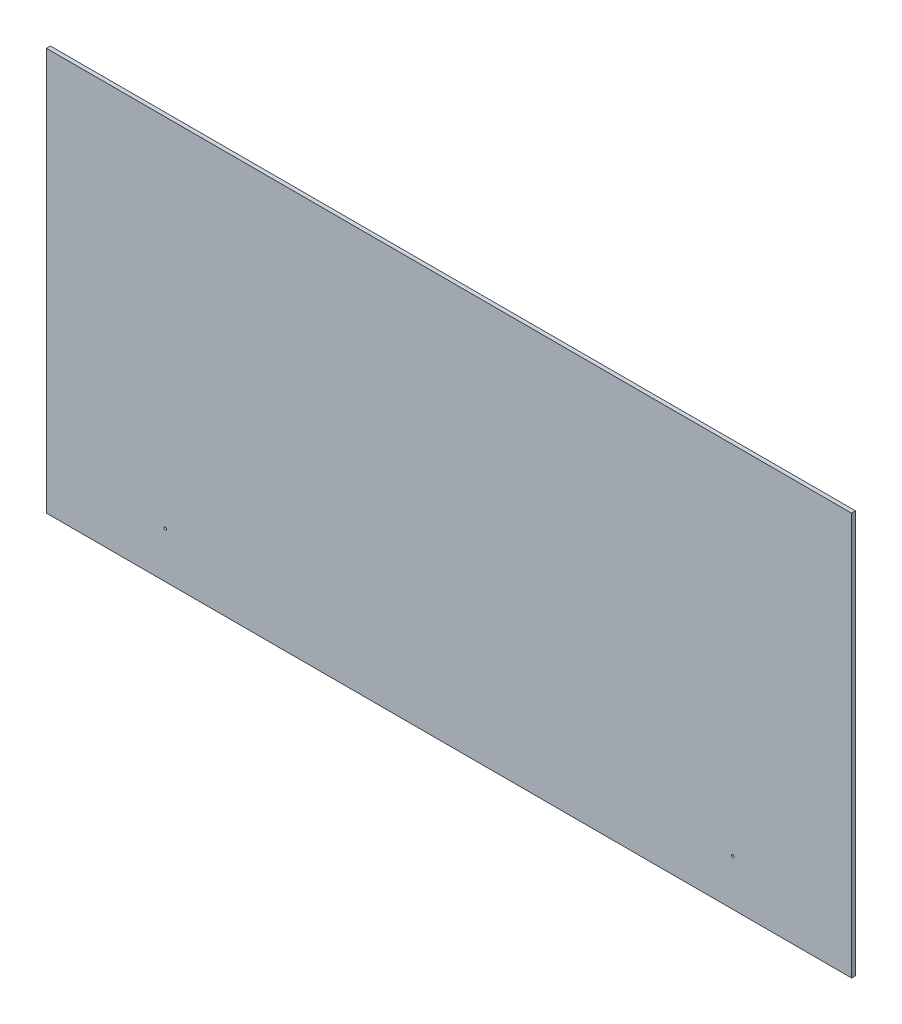
ISO-10303-21;
HEADER;
FILE_DESCRIPTION(('STEP AP214'),'2;1');
FILE_NAME('part.step','',(''),(''),'','','');
FILE_SCHEMA(('AUTOMOTIVE_DESIGN { 1 0 10303 214 1 1 1 1 }'));
ENDSEC;
DATA;
#1=APPLICATION_CONTEXT('core data for automotive mechanical design processes');
#2=APPLICATION_PROTOCOL_DEFINITION('international standard','automotive_design',2000,#1);
#3=PRODUCT_CONTEXT('',#1,'mechanical');
#4=PRODUCT('Part','Part','',(#3));
#5=PRODUCT_RELATED_PRODUCT_CATEGORY('part','',(#4));
#6=PRODUCT_DEFINITION_FORMATION('','',#4);
#7=PRODUCT_DEFINITION_CONTEXT('part definition',#1,'design');
#8=PRODUCT_DEFINITION('design','',#6,#7);
#9=PRODUCT_DEFINITION_SHAPE('','',#8);
#10=(LENGTH_UNIT() NAMED_UNIT(*) SI_UNIT(.MILLI.,.METRE.));
#11=(NAMED_UNIT(*) PLANE_ANGLE_UNIT() SI_UNIT($,.RADIAN.));
#12=(NAMED_UNIT(*) SI_UNIT($,.STERADIAN.) SOLID_ANGLE_UNIT());
#13=UNCERTAINTY_MEASURE_WITH_UNIT(LENGTH_MEASURE(1.E-05),#10,'distance_accuracy_value','');
#14=(GEOMETRIC_REPRESENTATION_CONTEXT(3) GLOBAL_UNCERTAINTY_ASSIGNED_CONTEXT((#13)) GLOBAL_UNIT_ASSIGNED_CONTEXT((#10,
#11,#12)) REPRESENTATION_CONTEXT('',''));
#15=CARTESIAN_POINT('',(0.,0.,0.));
#16=DIRECTION('',(0.,0.,1.));
#17=DIRECTION('',(1.,0.,0.));
#18=AXIS2_PLACEMENT_3D('',#15,#16,#17);
#19=CARTESIAN_POINT('',(0.,0.,6.));
#20=DIRECTION('',(-1.,0.,0.));
#21=DIRECTION('',(0.,0.,1.));
#22=AXIS2_PLACEMENT_3D('',#19,#20,#21);
#23=PLANE('',#22);
#24=DIRECTION('',(0.,1.,0.));
#25=VECTOR('',#24,1.);
#26=CARTESIAN_POINT('',(0.,0.,0.));
#27=LINE('',#26,#25);
#28=CARTESIAN_POINT('',(0.,0.,0.));
#29=VERTEX_POINT('',#28);
#30=CARTESIAN_POINT('',(0.,610.,0.));
#31=VERTEX_POINT('',#30);
#32=EDGE_CURVE('E108',#29,#31,#27,.T.);
#33=ORIENTED_EDGE('',*,*,#32,.T.);
#34=DIRECTION('',(0.,0.,-1.));
#35=VECTOR('',#34,1.);
#36=CARTESIAN_POINT('',(0.,610.,6.));
#37=LINE('',#36,#35);
#38=CARTESIAN_POINT('',(0.,610.,6.));
#39=VERTEX_POINT('',#38);
#40=EDGE_CURVE('E11',#39,#31,#37,.T.);
#41=ORIENTED_EDGE('',*,*,#40,.F.);
#42=DIRECTION('',(0.,1.,0.));
#43=VECTOR('',#42,1.);
#44=CARTESIAN_POINT('',(0.,0.,6.));
#45=LINE('',#44,#43);
#46=CARTESIAN_POINT('',(0.,0.,6.));
#47=VERTEX_POINT('',#46);
#48=EDGE_CURVE('E96',#47,#39,#45,.T.);
#49=ORIENTED_EDGE('',*,*,#48,.F.);
#50=DIRECTION('',(0.,0.,-1.));
#51=VECTOR('',#50,1.);
#52=CARTESIAN_POINT('',(0.,0.,6.));
#53=LINE('',#52,#51);
#54=EDGE_CURVE('E104',#47,#29,#53,.T.);
#55=ORIENTED_EDGE('',*,*,#54,.T.);
#56=EDGE_LOOP('',(#33,#41,#49,#55));
#57=FACE_BOUND('',#56,.T.);
#58=ADVANCED_FACE('F45',(#57),#23,.F.);
#59=CARTESIAN_POINT('',(0.,610.,6.));
#60=DIRECTION('',(0.,-1.,0.));
#61=DIRECTION('',(1.,0.,0.));
#62=AXIS2_PLACEMENT_3D('',#59,#60,#61);
#63=PLANE('',#62);
#64=DIRECTION('',(-1.,0.,0.));
#65=VECTOR('',#64,1.);
#66=CARTESIAN_POINT('',(0.,610.,0.));
#67=LINE('',#66,#65);
#68=CARTESIAN_POINT('',(-1220.,610.,0.));
#69=VERTEX_POINT('',#68);
#70=EDGE_CURVE('E100',#31,#69,#67,.T.);
#71=ORIENTED_EDGE('',*,*,#70,.T.);
#72=DIRECTION('',(0.,0.,-1.));
#73=VECTOR('',#72,1.);
#74=CARTESIAN_POINT('',(-1220.,610.,6.));
#75=LINE('',#74,#73);
#76=CARTESIAN_POINT('',(-1220.,610.,6.));
#77=VERTEX_POINT('',#76);
#78=EDGE_CURVE('E53',#77,#69,#75,.T.);
#79=ORIENTED_EDGE('',*,*,#78,.F.);
#80=DIRECTION('',(-1.,0.,0.));
#81=VECTOR('',#80,1.);
#82=CARTESIAN_POINT('',(0.,610.,6.));
#83=LINE('',#82,#81);
#84=EDGE_CURVE('E91',#39,#77,#83,.T.);
#85=ORIENTED_EDGE('',*,*,#84,.F.);
#86=ORIENTED_EDGE('',*,*,#40,.T.);
#87=EDGE_LOOP('',(#71,#79,#85,#86));
#88=FACE_BOUND('',#87,.T.);
#89=ADVANCED_FACE('F99',(#88),#63,.F.);
#90=CARTESIAN_POINT('',(-1220.,-1.49406909495977E-13,6.));
#91=DIRECTION('',(1.,0.,0.));
#92=DIRECTION('',(0.,0.,-1.));
#93=AXIS2_PLACEMENT_3D('',#90,#91,#92);
#94=PLANE('',#93);
#95=DIRECTION('',(0.,-1.,0.));
#96=VECTOR('',#95,1.);
#97=CARTESIAN_POINT('',(-1220.,-1.49406909495977E-13,0.));
#98=LINE('',#97,#96);
#99=CARTESIAN_POINT('',(-1220.,-1.49406909495977E-13,0.));
#100=VERTEX_POINT('',#99);
#101=EDGE_CURVE('E78',#69,#100,#98,.T.);
#102=ORIENTED_EDGE('',*,*,#101,.T.);
#103=DIRECTION('',(0.,0.,-1.));
#104=VECTOR('',#103,1.);
#105=CARTESIAN_POINT('',(-1220.,-1.49406909495977E-13,6.));
#106=LINE('',#105,#104);
#107=CARTESIAN_POINT('',(-1220.,-1.49406909495977E-13,6.));
#108=VERTEX_POINT('',#107);
#109=EDGE_CURVE('E101',#108,#100,#106,.T.);
#110=ORIENTED_EDGE('',*,*,#109,.F.);
#111=DIRECTION('',(0.,-1.,0.));
#112=VECTOR('',#111,1.);
#113=CARTESIAN_POINT('',(-1220.,-1.49406909495977E-13,6.));
#114=LINE('',#113,#112);
#115=EDGE_CURVE('E94',#77,#108,#114,.T.);
#116=ORIENTED_EDGE('',*,*,#115,.F.);
#117=ORIENTED_EDGE('',*,*,#78,.T.);
#118=EDGE_LOOP('',(#102,#110,#116,#117));
#119=FACE_BOUND('',#118,.T.);
#120=ADVANCED_FACE('F102',(#119),#94,.F.);
#121=CARTESIAN_POINT('',(0.,0.,6.));
#122=DIRECTION('',(0.,1.,0.));
#123=DIRECTION('',(-1.,0.,0.));
#124=AXIS2_PLACEMENT_3D('',#121,#122,#123);
#125=PLANE('',#124);
#126=DIRECTION('',(1.,0.,0.));
#127=VECTOR('',#126,1.);
#128=CARTESIAN_POINT('',(0.,0.,0.));
#129=LINE('',#128,#127);
#130=EDGE_CURVE('E84',#100,#29,#129,.T.);
#131=ORIENTED_EDGE('',*,*,#130,.T.);
#132=ORIENTED_EDGE('',*,*,#54,.F.);
#133=DIRECTION('',(1.,0.,0.));
#134=VECTOR('',#133,1.);
#135=CARTESIAN_POINT('',(0.,0.,6.));
#136=LINE('',#135,#134);
#137=EDGE_CURVE('E61',#108,#47,#136,.T.);
#138=ORIENTED_EDGE('',*,*,#137,.F.);
#139=ORIENTED_EDGE('',*,*,#109,.T.);
#140=EDGE_LOOP('',(#131,#132,#138,#139));
#141=FACE_BOUND('',#140,.T.);
#142=ADVANCED_FACE('F116',(#141),#125,.F.);
#143=CARTESIAN_POINT('',(0.,0.,6.));
#144=DIRECTION('',(0.,0.,1.));
#145=DIRECTION('',(1.,0.,0.));
#146=AXIS2_PLACEMENT_3D('',#143,#144,#145);
#147=PLANE('',#146);
#148=CARTESIAN_POINT('',(-1040.,69.9999999999998,6.));
#149=DIRECTION('',(0.,0.,1.));
#150=DIRECTION('',(1.,0.,0.));
#151=AXIS2_PLACEMENT_3D('',#148,#149,#150);
#152=CIRCLE('',#151,2.0000000000001);
#153=CARTESIAN_POINT('',(-1038.,69.9999999999998,6.));
#154=VERTEX_POINT('',#153);
#155=EDGE_CURVE('E125',#154,#154,#152,.T.);
#156=ORIENTED_EDGE('',*,*,#155,.F.);
#157=EDGE_LOOP('',(#156));
#158=FACE_BOUND('',#157,.T.);
#159=CARTESIAN_POINT('',(-180.,69.9999999999998,6.));
#160=DIRECTION('',(0.,0.,1.));
#161=DIRECTION('',(-1.,0.,0.));
#162=AXIS2_PLACEMENT_3D('',#159,#160,#161);
#163=CIRCLE('',#162,2.0000000000001);
#164=CARTESIAN_POINT('',(-182.,69.9999999999998,6.));
#165=VERTEX_POINT('',#164);
#166=EDGE_CURVE('E122',#165,#165,#163,.T.);
#167=ORIENTED_EDGE('',*,*,#166,.F.);
#168=EDGE_LOOP('',(#167));
#169=FACE_BOUND('',#168,.T.);
#170=ORIENTED_EDGE('',*,*,#48,.T.);
#171=ORIENTED_EDGE('',*,*,#84,.T.);
#172=ORIENTED_EDGE('',*,*,#115,.T.);
#173=ORIENTED_EDGE('',*,*,#137,.T.);
#174=EDGE_LOOP('',(#170,#171,#172,#173));
#175=FACE_BOUND('',#174,.T.);
#176=ADVANCED_FACE('F92',(#158,#169,#175),#147,.T.);
#177=CARTESIAN_POINT('',(0.,0.,0.));
#178=DIRECTION('',(0.,0.,1.));
#179=DIRECTION('',(1.,0.,0.));
#180=AXIS2_PLACEMENT_3D('',#177,#178,#179);
#181=PLANE('',#180);
#182=CARTESIAN_POINT('',(-1040.,69.9999999999998,0.));
#183=DIRECTION('',(0.,0.,1.));
#184=DIRECTION('',(1.,0.,0.));
#185=AXIS2_PLACEMENT_3D('',#182,#183,#184);
#186=CIRCLE('',#185,2.0000000000001);
#187=CARTESIAN_POINT('',(-1038.,69.9999999999998,0.));
#188=VERTEX_POINT('',#187);
#189=EDGE_CURVE('E111',#188,#188,#186,.F.);
#190=ORIENTED_EDGE('',*,*,#189,.F.);
#191=EDGE_LOOP('',(#190));
#192=FACE_BOUND('',#191,.T.);
#193=CARTESIAN_POINT('',(-180.,69.9999999999998,0.));
#194=DIRECTION('',(0.,0.,1.));
#195=DIRECTION('',(1.,0.,0.));
#196=AXIS2_PLACEMENT_3D('',#193,#194,#195);
#197=CIRCLE('',#196,2.0000000000001);
#198=CARTESIAN_POINT('',(-178.,69.9999999999998,0.));
#199=VERTEX_POINT('',#198);
#200=EDGE_CURVE('E126',#199,#199,#197,.F.);
#201=ORIENTED_EDGE('',*,*,#200,.F.);
#202=EDGE_LOOP('',(#201));
#203=FACE_BOUND('',#202,.T.);
#204=ORIENTED_EDGE('',*,*,#32,.F.);
#205=ORIENTED_EDGE('',*,*,#130,.F.);
#206=ORIENTED_EDGE('',*,*,#101,.F.);
#207=ORIENTED_EDGE('',*,*,#70,.F.);
#208=EDGE_LOOP('',(#204,#205,#206,#207));
#209=FACE_BOUND('',#208,.T.);
#210=ADVANCED_FACE('F119',(#192,#203,#209),#181,.F.);
#211=CARTESIAN_POINT('',(-180.,69.9999999999998,-5.65685424949268));
#212=DIRECTION('',(0.,0.,1.));
#213=DIRECTION('',(1.,0.,0.));
#214=AXIS2_PLACEMENT_3D('',#211,#212,#213);
#215=CYLINDRICAL_SURFACE('',#214,2.0000000000001);
#216=ORIENTED_EDGE('',*,*,#200,.T.);
#217=EDGE_LOOP('',(#216));
#218=FACE_BOUND('',#217,.T.);
#219=ORIENTED_EDGE('',*,*,#166,.T.);
#220=EDGE_LOOP('',(#219));
#221=FACE_BOUND('',#220,.T.);
#222=ADVANCED_FACE('F141',(#218,#221),#215,.F.);
#223=CARTESIAN_POINT('',(-1040.,69.9999999999998,-5.65685424949268));
#224=DIRECTION('',(0.,0.,1.));
#225=DIRECTION('',(1.,0.,0.));
#226=AXIS2_PLACEMENT_3D('',#223,#224,#225);
#227=CYLINDRICAL_SURFACE('',#226,2.0000000000001);
#228=ORIENTED_EDGE('',*,*,#189,.T.);
#229=EDGE_LOOP('',(#228));
#230=FACE_BOUND('',#229,.T.);
#231=ORIENTED_EDGE('',*,*,#155,.T.);
#232=EDGE_LOOP('',(#231));
#233=FACE_BOUND('',#232,.T.);
#234=ADVANCED_FACE('F134',(#230,#233),#227,.F.);
#235=CLOSED_SHELL('',(#58,#89,#120,#142,#176,#210,#222,#234));
#236=MANIFOLD_SOLID_BREP('B2',#235);
#237=ADVANCED_BREP_SHAPE_REPRESENTATION('',(#18,#236),#14);
#238=SHAPE_DEFINITION_REPRESENTATION(#9,#237);
ENDSEC;
END-ISO-10303-21;
